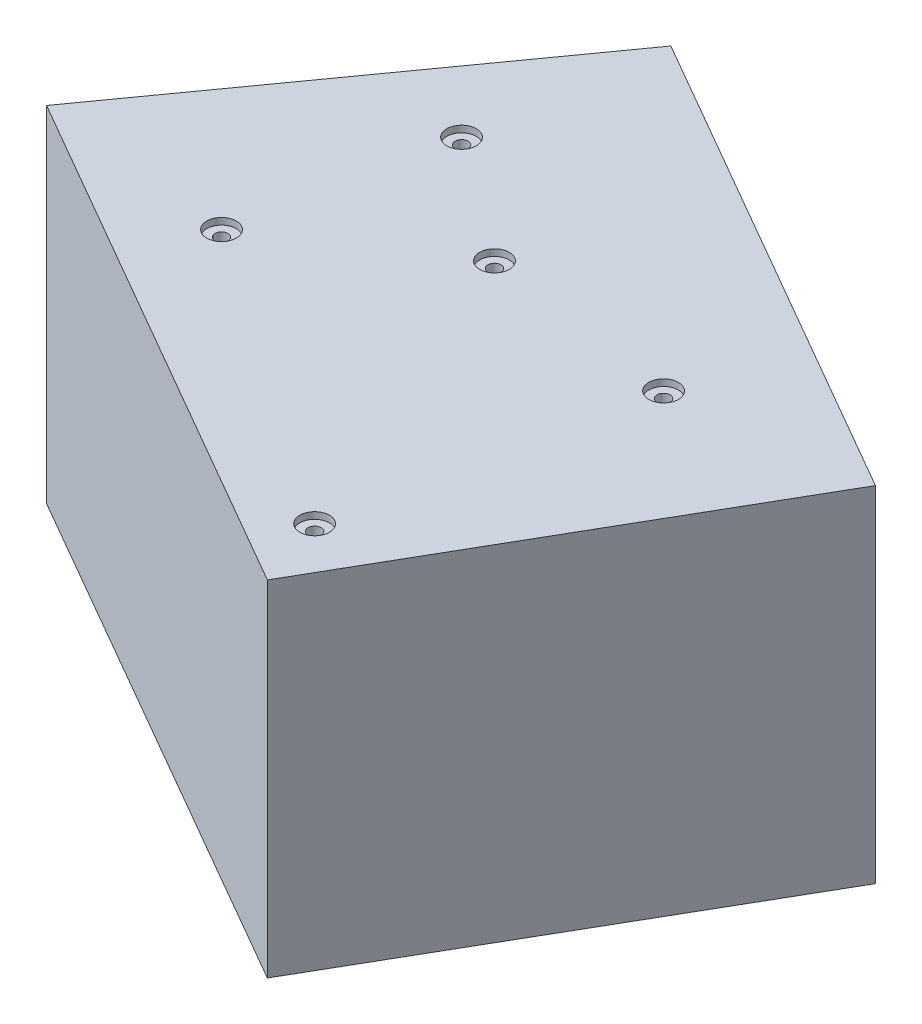
ISO-10303-21;
HEADER;
FILE_DESCRIPTION(('STEP AP214'),'2;1');
FILE_NAME('part.step','',(''),(''),'','','');
FILE_SCHEMA(('AUTOMOTIVE_DESIGN { 1 0 10303 214 1 1 1 1 }'));
ENDSEC;
DATA;
#1=APPLICATION_CONTEXT('core data for automotive mechanical design processes');
#2=APPLICATION_PROTOCOL_DEFINITION('international standard','automotive_design',2000,#1);
#3=PRODUCT_CONTEXT('',#1,'mechanical');
#4=PRODUCT('Part','Part','',(#3));
#5=PRODUCT_RELATED_PRODUCT_CATEGORY('part','',(#4));
#6=PRODUCT_DEFINITION_FORMATION('','',#4);
#7=PRODUCT_DEFINITION_CONTEXT('part definition',#1,'design');
#8=PRODUCT_DEFINITION('design','',#6,#7);
#9=PRODUCT_DEFINITION_SHAPE('','',#8);
#10=(LENGTH_UNIT() NAMED_UNIT(*) SI_UNIT(.MILLI.,.METRE.));
#11=(NAMED_UNIT(*) PLANE_ANGLE_UNIT() SI_UNIT($,.RADIAN.));
#12=(NAMED_UNIT(*) SI_UNIT($,.STERADIAN.) SOLID_ANGLE_UNIT());
#13=UNCERTAINTY_MEASURE_WITH_UNIT(LENGTH_MEASURE(1.E-05),#10,'distance_accuracy_value','');
#14=(GEOMETRIC_REPRESENTATION_CONTEXT(3) GLOBAL_UNCERTAINTY_ASSIGNED_CONTEXT((#13)) GLOBAL_UNIT_ASSIGNED_CONTEXT((#10,
#11,#12)) REPRESENTATION_CONTEXT('',''));
#15=CARTESIAN_POINT('',(0.,0.,0.));
#16=DIRECTION('',(0.,0.,1.));
#17=DIRECTION('',(1.,0.,0.));
#18=AXIS2_PLACEMENT_3D('',#15,#16,#17);
#19=CARTESIAN_POINT('',(20.345351388883,37.,-35.2961020307136));
#20=DIRECTION('',(-0.499394896140882,0.,0.866374478911075));
#21=DIRECTION('',(0.866374478911076,0.,0.499394896140882));
#22=AXIS2_PLACEMENT_3D('',#19,#20,#21);
#23=PLANE('',#22);
#24=DIRECTION('',(-0.866374478911076,0.,-0.499394896140882));
#25=VECTOR('',#24,1.);
#26=CARTESIAN_POINT('',(20.345351388883,0.,-35.2961020307136));
#27=LINE('',#26,#25);
#28=CARTESIAN_POINT('',(41.3321038299781,0.,-23.1989346847549));
#29=VERTEX_POINT('',#28);
#30=CARTESIAN_POINT('',(-10.5053924694506,0.,-53.0790635560413));
#31=VERTEX_POINT('',#30);
#32=EDGE_CURVE('E96',#29,#31,#27,.T.);
#33=ORIENTED_EDGE('',*,*,#32,.T.);
#34=DIRECTION('',(0.,-1.,0.));
#35=VECTOR('',#34,1.);
#36=CARTESIAN_POINT('',(-10.5053924694506,37.,-53.0790635560413));
#37=LINE('',#36,#35);
#38=CARTESIAN_POINT('',(-10.5053924694506,37.,-53.0790635560413));
#39=VERTEX_POINT('',#38);
#40=EDGE_CURVE('E11',#39,#31,#37,.T.);
#41=ORIENTED_EDGE('',*,*,#40,.F.);
#42=DIRECTION('',(-0.866374478911076,0.,-0.499394896140882));
#43=VECTOR('',#42,1.);
#44=CARTESIAN_POINT('',(20.345351388883,37.,-35.2961020307136));
#45=LINE('',#44,#43);
#46=CARTESIAN_POINT('',(41.3321038299781,37.,-23.1989346847549));
#47=VERTEX_POINT('',#46);
#48=EDGE_CURVE('E84',#47,#39,#45,.T.);
#49=ORIENTED_EDGE('',*,*,#48,.F.);
#50=DIRECTION('',(0.,-1.,0.));
#51=VECTOR('',#50,1.);
#52=CARTESIAN_POINT('',(41.3321038299781,37.,-23.1989346847549));
#53=LINE('',#52,#51);
#54=EDGE_CURVE('E92',#47,#29,#53,.T.);
#55=ORIENTED_EDGE('',*,*,#54,.T.);
#56=EDGE_LOOP('',(#33,#41,#49,#55));
#57=FACE_BOUND('',#56,.T.);
#58=ADVANCED_FACE('F33',(#57),#23,.F.);
#59=CARTESIAN_POINT('',(-32.0727236267582,37.,-22.9865477615255));
#60=DIRECTION('',(0.812803978277664,0.,0.582537288845961));
#61=DIRECTION('',(0.582537288845961,0.,-0.812803978277664));
#62=AXIS2_PLACEMENT_3D('',#59,#60,#61);
#63=PLANE('',#62);
#64=DIRECTION('',(-0.582537288845961,0.,0.812803978277664));
#65=VECTOR('',#64,1.);
#66=CARTESIAN_POINT('',(-32.0727236267582,0.,-22.9865477615255));
#67=LINE('',#66,#65);
#68=CARTESIAN_POINT('',(-38.4790538125223,0.,-14.0479085347304));
#69=VERTEX_POINT('',#68);
#70=EDGE_CURVE('E88',#31,#69,#67,.T.);
#71=ORIENTED_EDGE('',*,*,#70,.T.);
#72=DIRECTION('',(0.,-1.,0.));
#73=VECTOR('',#72,1.);
#74=CARTESIAN_POINT('',(-38.4790538125223,37.,-14.0479085347304));
#75=LINE('',#74,#73);
#76=CARTESIAN_POINT('',(-38.4790538125223,37.,-14.0479085347304));
#77=VERTEX_POINT('',#76);
#78=EDGE_CURVE('E41',#77,#69,#75,.T.);
#79=ORIENTED_EDGE('',*,*,#78,.F.);
#80=DIRECTION('',(-0.582537288845961,0.,0.812803978277664));
#81=VECTOR('',#80,1.);
#82=CARTESIAN_POINT('',(-32.0727236267582,37.,-22.9865477615255));
#83=LINE('',#82,#81);
#84=EDGE_CURVE('E79',#39,#77,#83,.T.);
#85=ORIENTED_EDGE('',*,*,#84,.F.);
#86=ORIENTED_EDGE('',*,*,#40,.T.);
#87=EDGE_LOOP('',(#71,#79,#85,#86));
#88=FACE_BOUND('',#87,.T.);
#89=ADVANCED_FACE('F87',(#88),#63,.F.);
#90=CARTESIAN_POINT('',(-3.51848356747383,37.,6.10403588599627));
#91=DIRECTION('',(0.499394896140882,0.,-0.866374478911075));
#92=DIRECTION('',(-0.866374478911076,0.,-0.499394896140882));
#93=AXIS2_PLACEMENT_3D('',#90,#91,#92);
#94=PLANE('',#93);
#95=DIRECTION('',(0.866374478911076,0.,0.499394896140882));
#96=VECTOR('',#95,1.);
#97=CARTESIAN_POINT('',(-3.51848356747383,0.,6.10403588599627));
#98=LINE('',#97,#96);
#99=CARTESIAN_POINT('',(17.4682688736212,0.,18.201203231955));
#100=VERTEX_POINT('',#99);
#101=EDGE_CURVE('E66',#69,#100,#98,.T.);
#102=ORIENTED_EDGE('',*,*,#101,.T.);
#103=DIRECTION('',(0.,-1.,0.));
#104=VECTOR('',#103,1.);
#105=CARTESIAN_POINT('',(17.4682688736212,37.,18.201203231955));
#106=LINE('',#105,#104);
#107=CARTESIAN_POINT('',(17.4682688736212,37.,18.201203231955));
#108=VERTEX_POINT('',#107);
#109=EDGE_CURVE('E89',#108,#100,#106,.T.);
#110=ORIENTED_EDGE('',*,*,#109,.F.);
#111=DIRECTION('',(0.866374478911076,0.,0.499394896140882));
#112=VECTOR('',#111,1.);
#113=CARTESIAN_POINT('',(-3.51848356747383,37.,6.10403588599627));
#114=LINE('',#113,#112);
#115=EDGE_CURVE('E82',#77,#108,#114,.T.);
#116=ORIENTED_EDGE('',*,*,#115,.F.);
#117=ORIENTED_EDGE('',*,*,#78,.T.);
#118=EDGE_LOOP('',(#102,#110,#116,#117));
#119=FACE_BOUND('',#118,.T.);
#120=ADVANCED_FACE('F90',(#119),#94,.F.);
#121=CARTESIAN_POINT('',(20.9867524410951,37.,12.0971673459587));
#122=DIRECTION('',(-0.866374478911075,0.,-0.499394896140882));
#123=DIRECTION('',(-0.499394896140882,0.,0.866374478911075));
#124=AXIS2_PLACEMENT_3D('',#121,#122,#123);
#125=PLANE('',#124);
#126=DIRECTION('',(0.499394896140882,0.,-0.866374478911075));
#127=VECTOR('',#126,1.);
#128=CARTESIAN_POINT('',(20.9867524410951,0.,12.0971673459587));
#129=LINE('',#128,#127);
#130=EDGE_CURVE('E72',#100,#29,#129,.T.);
#131=ORIENTED_EDGE('',*,*,#130,.T.);
#132=ORIENTED_EDGE('',*,*,#54,.F.);
#133=DIRECTION('',(0.499394896140882,0.,-0.866374478911075));
#134=VECTOR('',#133,1.);
#135=CARTESIAN_POINT('',(20.9867524410951,37.,12.0971673459587));
#136=LINE('',#135,#134);
#137=EDGE_CURVE('E49',#108,#47,#136,.T.);
#138=ORIENTED_EDGE('',*,*,#137,.F.);
#139=ORIENTED_EDGE('',*,*,#109,.T.);
#140=EDGE_LOOP('',(#131,#132,#138,#139));
#141=FACE_BOUND('',#140,.T.);
#142=ADVANCED_FACE('F104',(#141),#125,.F.);
#143=CARTESIAN_POINT('',(0.,37.,0.));
#144=DIRECTION('',(0.,1.,0.));
#145=DIRECTION('',(0.,0.,1.));
#146=AXIS2_PLACEMENT_3D('',#143,#144,#145);
#147=PLANE('',#146);
#148=CARTESIAN_POINT('',(14.7823041001516,37.,10.4421374865638));
#149=DIRECTION('',(0.,1.,0.));
#150=DIRECTION('',(0.,0.,1.));
#151=AXIS2_PLACEMENT_3D('',#148,#149,#150);
#152=CIRCLE('',#151,1.5875);
#153=CARTESIAN_POINT('',(14.7823041001516,37.,12.0296374865637));
#154=VERTEX_POINT('',#153);
#155=EDGE_CURVE('E166',#154,#154,#152,.T.);
#156=ORIENTED_EDGE('',*,*,#155,.F.);
#157=EDGE_LOOP('',(#156));
#158=FACE_BOUND('',#157,.T.);
#159=CARTESIAN_POINT('',(0.,37.,-23.6416541667381));
#160=DIRECTION('',(0.,1.,0.));
#161=DIRECTION('',(0.,0.,1.));
#162=AXIS2_PLACEMENT_3D('',#159,#160,#161);
#163=CIRCLE('',#162,1.5875);
#164=CARTESIAN_POINT('',(0.,37.,-22.0541541667381));
#165=VERTEX_POINT('',#164);
#166=EDGE_CURVE('E154',#165,#165,#163,.T.);
#167=ORIENTED_EDGE('',*,*,#166,.F.);
#168=EDGE_LOOP('',(#167));
#169=FACE_BOUND('',#168,.T.);
#170=CARTESIAN_POINT('',(21.1628590037662,37.,-20.6303003542985));
#171=DIRECTION('',(0.,1.,0.));
#172=DIRECTION('',(0.,0.,1.));
#173=AXIS2_PLACEMENT_3D('',#170,#171,#172);
#174=CIRCLE('',#173,1.5875);
#175=CARTESIAN_POINT('',(21.1628590037662,37.,-19.0428003542985));
#176=VERTEX_POINT('',#175);
#177=EDGE_CURVE('E142',#176,#176,#174,.T.);
#178=ORIENTED_EDGE('',*,*,#177,.F.);
#179=EDGE_LOOP('',(#178));
#180=FACE_BOUND('',#179,.T.);
#181=CARTESIAN_POINT('',(-17.558591276611,37.,-11.9070774753709));
#182=DIRECTION('',(0.,1.,0.));
#183=DIRECTION('',(0.,0.,1.));
#184=AXIS2_PLACEMENT_3D('',#181,#182,#183);
#185=CIRCLE('',#184,1.5875);
#186=CARTESIAN_POINT('',(-17.558591276611,37.,-10.3195774753709));
#187=VERTEX_POINT('',#186);
#188=EDGE_CURVE('E130',#187,#187,#185,.T.);
#189=ORIENTED_EDGE('',*,*,#188,.F.);
#190=EDGE_LOOP('',(#189));
#191=FACE_BOUND('',#190,.T.);
#192=CARTESIAN_POINT('',(-13.2542559478566,37.,-33.3667928831005));
#193=DIRECTION('',(0.,1.,0.));
#194=DIRECTION('',(0.,0.,1.));
#195=AXIS2_PLACEMENT_3D('',#192,#193,#194);
#196=CIRCLE('',#195,1.5875);
#197=CARTESIAN_POINT('',(-13.2542559478566,37.,-31.7792928831005));
#198=VERTEX_POINT('',#197);
#199=EDGE_CURVE('E118',#198,#198,#196,.T.);
#200=ORIENTED_EDGE('',*,*,#199,.F.);
#201=EDGE_LOOP('',(#200));
#202=FACE_BOUND('',#201,.T.);
#203=ORIENTED_EDGE('',*,*,#48,.T.);
#204=ORIENTED_EDGE('',*,*,#84,.T.);
#205=ORIENTED_EDGE('',*,*,#115,.T.);
#206=ORIENTED_EDGE('',*,*,#137,.T.);
#207=EDGE_LOOP('',(#203,#204,#205,#206));
#208=FACE_BOUND('',#207,.T.);
#209=ADVANCED_FACE('F80',(#158,#169,#180,#191,#202,#208),#147,.T.);
#210=CARTESIAN_POINT('',(0.,0.,0.));
#211=DIRECTION('',(0.,1.,0.));
#212=DIRECTION('',(0.,0.,1.));
#213=AXIS2_PLACEMENT_3D('',#210,#211,#212);
#214=PLANE('',#213);
#215=CARTESIAN_POINT('',(14.7823041001516,0.,10.4421374865638));
#216=DIRECTION('',(0.,1.,0.));
#217=DIRECTION('',(0.,0.,1.));
#218=AXIS2_PLACEMENT_3D('',#215,#216,#217);
#219=CIRCLE('',#218,0.698499999999991);
#220=CARTESIAN_POINT('',(14.7823041001516,0.,11.1406374865637));
#221=VERTEX_POINT('',#220);
#222=EDGE_CURVE('E157',#221,#221,#219,.T.);
#223=ORIENTED_EDGE('',*,*,#222,.T.);
#224=EDGE_LOOP('',(#223));
#225=FACE_BOUND('',#224,.T.);
#226=CARTESIAN_POINT('',(0.,0.,-23.6416541667381));
#227=DIRECTION('',(0.,1.,0.));
#228=DIRECTION('',(0.,0.,1.));
#229=AXIS2_PLACEMENT_3D('',#226,#227,#228);
#230=CIRCLE('',#229,0.698499999999991);
#231=CARTESIAN_POINT('',(0.,0.,-22.9431541667381));
#232=VERTEX_POINT('',#231);
#233=EDGE_CURVE('E145',#232,#232,#230,.T.);
#234=ORIENTED_EDGE('',*,*,#233,.T.);
#235=EDGE_LOOP('',(#234));
#236=FACE_BOUND('',#235,.T.);
#237=CARTESIAN_POINT('',(21.1628590037662,0.,-20.6303003542985));
#238=DIRECTION('',(0.,1.,0.));
#239=DIRECTION('',(0.,0.,1.));
#240=AXIS2_PLACEMENT_3D('',#237,#238,#239);
#241=CIRCLE('',#240,0.698499999999991);
#242=CARTESIAN_POINT('',(21.1628590037662,0.,-19.9318003542985));
#243=VERTEX_POINT('',#242);
#244=EDGE_CURVE('E133',#243,#243,#241,.T.);
#245=ORIENTED_EDGE('',*,*,#244,.T.);
#246=EDGE_LOOP('',(#245));
#247=FACE_BOUND('',#246,.T.);
#248=CARTESIAN_POINT('',(-17.558591276611,0.,-11.9070774753709));
#249=DIRECTION('',(0.,1.,0.));
#250=DIRECTION('',(0.,0.,1.));
#251=AXIS2_PLACEMENT_3D('',#248,#249,#250);
#252=CIRCLE('',#251,0.698499999999991);
#253=CARTESIAN_POINT('',(-17.558591276611,0.,-11.2085774753709));
#254=VERTEX_POINT('',#253);
#255=EDGE_CURVE('E121',#254,#254,#252,.T.);
#256=ORIENTED_EDGE('',*,*,#255,.T.);
#257=EDGE_LOOP('',(#256));
#258=FACE_BOUND('',#257,.T.);
#259=CARTESIAN_POINT('',(-13.2542559478566,0.,-33.3667928831005));
#260=DIRECTION('',(0.,1.,0.));
#261=DIRECTION('',(0.,0.,1.));
#262=AXIS2_PLACEMENT_3D('',#259,#260,#261);
#263=CIRCLE('',#262,0.698499999999991);
#264=CARTESIAN_POINT('',(-13.2542559478566,0.,-32.6682928831005));
#265=VERTEX_POINT('',#264);
#266=EDGE_CURVE('E99',#265,#265,#263,.T.);
#267=ORIENTED_EDGE('',*,*,#266,.T.);
#268=EDGE_LOOP('',(#267));
#269=FACE_BOUND('',#268,.T.);
#270=ORIENTED_EDGE('',*,*,#32,.F.);
#271=ORIENTED_EDGE('',*,*,#130,.F.);
#272=ORIENTED_EDGE('',*,*,#101,.F.);
#273=ORIENTED_EDGE('',*,*,#70,.F.);
#274=EDGE_LOOP('',(#270,#271,#272,#273));
#275=FACE_BOUND('',#274,.T.);
#276=ADVANCED_FACE('F107',(#225,#236,#247,#258,#269,#275),#214,.F.);
#277=CARTESIAN_POINT('',(-13.2542559478566,37.,-33.3667928831005));
#278=DIRECTION('',(0.,1.,0.));
#279=DIRECTION('',(0.,0.,1.));
#280=AXIS2_PLACEMENT_3D('',#277,#278,#279);
#281=CYLINDRICAL_SURFACE('',#280,0.698499999999995);
#282=ORIENTED_EDGE('',*,*,#266,.F.);
#283=EDGE_LOOP('',(#282));
#284=FACE_BOUND('',#283,.T.);
#285=CARTESIAN_POINT('',(-13.2542559478566,36.2888,-33.3667928831005));
#286=DIRECTION('',(0.,1.,0.));
#287=DIRECTION('',(0.,0.,1.));
#288=AXIS2_PLACEMENT_3D('',#285,#286,#287);
#289=CIRCLE('',#288,0.698499999999999);
#290=CARTESIAN_POINT('',(-13.2542559478566,36.2888,-32.6682928831005));
#291=VERTEX_POINT('',#290);
#292=EDGE_CURVE('E112',#291,#291,#289,.T.);
#293=ORIENTED_EDGE('',*,*,#292,.T.);
#294=EDGE_LOOP('',(#293));
#295=FACE_BOUND('',#294,.T.);
#296=ADVANCED_FACE('F196',(#284,#295),#281,.F.);
#297=CARTESIAN_POINT('',(-12.5557559478566,36.2888,-33.3667928831005));
#298=DIRECTION('',(0.,-1.,0.));
#299=DIRECTION('',(0.,0.,-1.));
#300=AXIS2_PLACEMENT_3D('',#297,#298,#299);
#301=PLANE('',#300);
#302=ORIENTED_EDGE('',*,*,#292,.F.);
#303=EDGE_LOOP('',(#302));
#304=FACE_BOUND('',#303,.T.);
#305=CARTESIAN_POINT('',(-13.2542559478566,36.2888,-33.3667928831005));
#306=DIRECTION('',(0.,1.,0.));
#307=DIRECTION('',(0.,0.,1.));
#308=AXIS2_PLACEMENT_3D('',#305,#306,#307);
#309=CIRCLE('',#308,1.5875);
#310=CARTESIAN_POINT('',(-13.2542559478566,36.2888,-31.7792928831005));
#311=VERTEX_POINT('',#310);
#312=EDGE_CURVE('E115',#311,#311,#309,.T.);
#313=ORIENTED_EDGE('',*,*,#312,.T.);
#314=EDGE_LOOP('',(#313));
#315=FACE_BOUND('',#314,.T.);
#316=ADVANCED_FACE('F186',(#304,#315),#301,.F.);
#317=CARTESIAN_POINT('',(-13.2542559478566,37.,-33.3667928831005));
#318=DIRECTION('',(0.,1.,0.));
#319=DIRECTION('',(0.,0.,1.));
#320=AXIS2_PLACEMENT_3D('',#317,#318,#319);
#321=CYLINDRICAL_SURFACE('',#320,1.5875);
#322=ORIENTED_EDGE('',*,*,#312,.F.);
#323=EDGE_LOOP('',(#322));
#324=FACE_BOUND('',#323,.T.);
#325=ORIENTED_EDGE('',*,*,#199,.T.);
#326=EDGE_LOOP('',(#325));
#327=FACE_BOUND('',#326,.T.);
#328=ADVANCED_FACE('F183',(#324,#327),#321,.F.);
#329=CARTESIAN_POINT('',(-17.558591276611,37.,-11.9070774753709));
#330=DIRECTION('',(0.,1.,0.));
#331=DIRECTION('',(0.,0.,1.));
#332=AXIS2_PLACEMENT_3D('',#329,#330,#331);
#333=CYLINDRICAL_SURFACE('',#332,0.698499999999996);
#334=ORIENTED_EDGE('',*,*,#255,.F.);
#335=EDGE_LOOP('',(#334));
#336=FACE_BOUND('',#335,.T.);
#337=CARTESIAN_POINT('',(-17.558591276611,36.2888,-11.9070774753709));
#338=DIRECTION('',(0.,1.,0.));
#339=DIRECTION('',(0.,0.,1.));
#340=AXIS2_PLACEMENT_3D('',#337,#338,#339);
#341=CIRCLE('',#340,0.698500000000001);
#342=CARTESIAN_POINT('',(-17.558591276611,36.2888,-11.2085774753709));
#343=VERTEX_POINT('',#342);
#344=EDGE_CURVE('E124',#343,#343,#341,.T.);
#345=ORIENTED_EDGE('',*,*,#344,.T.);
#346=EDGE_LOOP('',(#345));
#347=FACE_BOUND('',#346,.T.);
#348=ADVANCED_FACE('F185',(#336,#347),#333,.F.);
#349=CARTESIAN_POINT('',(-16.860091276611,36.2888,-11.9070774753709));
#350=DIRECTION('',(0.,-1.,0.));
#351=DIRECTION('',(0.,0.,-1.));
#352=AXIS2_PLACEMENT_3D('',#349,#350,#351);
#353=PLANE('',#352);
#354=ORIENTED_EDGE('',*,*,#344,.F.);
#355=EDGE_LOOP('',(#354));
#356=FACE_BOUND('',#355,.T.);
#357=CARTESIAN_POINT('',(-17.558591276611,36.2888,-11.9070774753709));
#358=DIRECTION('',(0.,1.,0.));
#359=DIRECTION('',(0.,0.,1.));
#360=AXIS2_PLACEMENT_3D('',#357,#358,#359);
#361=CIRCLE('',#360,1.5875);
#362=CARTESIAN_POINT('',(-17.558591276611,36.2888,-10.3195774753709));
#363=VERTEX_POINT('',#362);
#364=EDGE_CURVE('E127',#363,#363,#361,.T.);
#365=ORIENTED_EDGE('',*,*,#364,.T.);
#366=EDGE_LOOP('',(#365));
#367=FACE_BOUND('',#366,.T.);
#368=ADVANCED_FACE('F193',(#356,#367),#353,.F.);
#369=CARTESIAN_POINT('',(-17.558591276611,37.,-11.9070774753709));
#370=DIRECTION('',(0.,1.,0.));
#371=DIRECTION('',(0.,0.,1.));
#372=AXIS2_PLACEMENT_3D('',#369,#370,#371);
#373=CYLINDRICAL_SURFACE('',#372,1.5875);
#374=ORIENTED_EDGE('',*,*,#364,.F.);
#375=EDGE_LOOP('',(#374));
#376=FACE_BOUND('',#375,.T.);
#377=ORIENTED_EDGE('',*,*,#188,.T.);
#378=EDGE_LOOP('',(#377));
#379=FACE_BOUND('',#378,.T.);
#380=ADVANCED_FACE('F248',(#376,#379),#373,.F.);
#381=CARTESIAN_POINT('',(21.1628590037662,37.,-20.6303003542985));
#382=DIRECTION('',(0.,1.,0.));
#383=DIRECTION('',(0.,0.,1.));
#384=AXIS2_PLACEMENT_3D('',#381,#382,#383);
#385=CYLINDRICAL_SURFACE('',#384,0.698499999999996);
#386=ORIENTED_EDGE('',*,*,#244,.F.);
#387=EDGE_LOOP('',(#386));
#388=FACE_BOUND('',#387,.T.);
#389=CARTESIAN_POINT('',(21.1628590037662,36.2888,-20.6303003542985));
#390=DIRECTION('',(0.,1.,0.));
#391=DIRECTION('',(0.,0.,1.));
#392=AXIS2_PLACEMENT_3D('',#389,#390,#391);
#393=CIRCLE('',#392,0.698500000000001);
#394=CARTESIAN_POINT('',(21.1628590037662,36.2888,-19.9318003542985));
#395=VERTEX_POINT('',#394);
#396=EDGE_CURVE('E136',#395,#395,#393,.T.);
#397=ORIENTED_EDGE('',*,*,#396,.T.);
#398=EDGE_LOOP('',(#397));
#399=FACE_BOUND('',#398,.T.);
#400=ADVANCED_FACE('F258',(#388,#399),#385,.F.);
#401=CARTESIAN_POINT('',(21.8613590037662,36.2888,-20.6303003542985));
#402=DIRECTION('',(0.,-1.,0.));
#403=DIRECTION('',(0.,0.,-1.));
#404=AXIS2_PLACEMENT_3D('',#401,#402,#403);
#405=PLANE('',#404);
#406=ORIENTED_EDGE('',*,*,#396,.F.);
#407=EDGE_LOOP('',(#406));
#408=FACE_BOUND('',#407,.T.);
#409=CARTESIAN_POINT('',(21.1628590037662,36.2888,-20.6303003542985));
#410=DIRECTION('',(0.,1.,0.));
#411=DIRECTION('',(0.,0.,1.));
#412=AXIS2_PLACEMENT_3D('',#409,#410,#411);
#413=CIRCLE('',#412,1.5875);
#414=CARTESIAN_POINT('',(21.1628590037662,36.2888,-19.0428003542985));
#415=VERTEX_POINT('',#414);
#416=EDGE_CURVE('E139',#415,#415,#413,.T.);
#417=ORIENTED_EDGE('',*,*,#416,.T.);
#418=EDGE_LOOP('',(#417));
#419=FACE_BOUND('',#418,.T.);
#420=ADVANCED_FACE('F268',(#408,#419),#405,.F.);
#421=CARTESIAN_POINT('',(21.1628590037662,37.,-20.6303003542985));
#422=DIRECTION('',(0.,1.,0.));
#423=DIRECTION('',(0.,0.,1.));
#424=AXIS2_PLACEMENT_3D('',#421,#422,#423);
#425=CYLINDRICAL_SURFACE('',#424,1.5875);
#426=ORIENTED_EDGE('',*,*,#416,.F.);
#427=EDGE_LOOP('',(#426));
#428=FACE_BOUND('',#427,.T.);
#429=ORIENTED_EDGE('',*,*,#177,.T.);
#430=EDGE_LOOP('',(#429));
#431=FACE_BOUND('',#430,.T.);
#432=ADVANCED_FACE('F278',(#428,#431),#425,.F.);
#433=CARTESIAN_POINT('',(0.,37.,-23.6416541667381));
#434=DIRECTION('',(0.,1.,0.));
#435=DIRECTION('',(0.,0.,1.));
#436=AXIS2_PLACEMENT_3D('',#433,#434,#435);
#437=CYLINDRICAL_SURFACE('',#436,0.698499999999995);
#438=ORIENTED_EDGE('',*,*,#233,.F.);
#439=EDGE_LOOP('',(#438));
#440=FACE_BOUND('',#439,.T.);
#441=CARTESIAN_POINT('',(0.,36.2888,-23.6416541667381));
#442=DIRECTION('',(0.,1.,0.));
#443=DIRECTION('',(0.,0.,1.));
#444=AXIS2_PLACEMENT_3D('',#441,#442,#443);
#445=CIRCLE('',#444,0.6985);
#446=CARTESIAN_POINT('',(0.,36.2888,-22.9431541667381));
#447=VERTEX_POINT('',#446);
#448=EDGE_CURVE('E148',#447,#447,#445,.T.);
#449=ORIENTED_EDGE('',*,*,#448,.T.);
#450=EDGE_LOOP('',(#449));
#451=FACE_BOUND('',#450,.T.);
#452=ADVANCED_FACE('F288',(#440,#451),#437,.F.);
#453=CARTESIAN_POINT('',(0.6985,36.2888,-23.6416541667381));
#454=DIRECTION('',(0.,-1.,0.));
#455=DIRECTION('',(0.,0.,-1.));
#456=AXIS2_PLACEMENT_3D('',#453,#454,#455);
#457=PLANE('',#456);
#458=ORIENTED_EDGE('',*,*,#448,.F.);
#459=EDGE_LOOP('',(#458));
#460=FACE_BOUND('',#459,.T.);
#461=CARTESIAN_POINT('',(0.,36.2888,-23.6416541667381));
#462=DIRECTION('',(0.,1.,0.));
#463=DIRECTION('',(0.,0.,1.));
#464=AXIS2_PLACEMENT_3D('',#461,#462,#463);
#465=CIRCLE('',#464,1.5875);
#466=CARTESIAN_POINT('',(0.,36.2888,-22.0541541667381));
#467=VERTEX_POINT('',#466);
#468=EDGE_CURVE('E151',#467,#467,#465,.T.);
#469=ORIENTED_EDGE('',*,*,#468,.T.);
#470=EDGE_LOOP('',(#469));
#471=FACE_BOUND('',#470,.T.);
#472=ADVANCED_FACE('F298',(#460,#471),#457,.F.);
#473=CARTESIAN_POINT('',(0.,37.,-23.6416541667381));
#474=DIRECTION('',(0.,1.,0.));
#475=DIRECTION('',(0.,0.,1.));
#476=AXIS2_PLACEMENT_3D('',#473,#474,#475);
#477=CYLINDRICAL_SURFACE('',#476,1.5875);
#478=ORIENTED_EDGE('',*,*,#468,.F.);
#479=EDGE_LOOP('',(#478));
#480=FACE_BOUND('',#479,.T.);
#481=ORIENTED_EDGE('',*,*,#166,.T.);
#482=EDGE_LOOP('',(#481));
#483=FACE_BOUND('',#482,.T.);
#484=ADVANCED_FACE('F308',(#480,#483),#477,.F.);
#485=CARTESIAN_POINT('',(14.7823041001516,37.,10.4421374865638));
#486=DIRECTION('',(0.,1.,0.));
#487=DIRECTION('',(0.,0.,1.));
#488=AXIS2_PLACEMENT_3D('',#485,#486,#487);
#489=CYLINDRICAL_SURFACE('',#488,0.698499999999995);
#490=ORIENTED_EDGE('',*,*,#222,.F.);
#491=EDGE_LOOP('',(#490));
#492=FACE_BOUND('',#491,.T.);
#493=CARTESIAN_POINT('',(14.7823041001516,36.2888,10.4421374865638));
#494=DIRECTION('',(0.,1.,0.));
#495=DIRECTION('',(0.,0.,1.));
#496=AXIS2_PLACEMENT_3D('',#493,#494,#495);
#497=CIRCLE('',#496,0.698499999999999);
#498=CARTESIAN_POINT('',(14.7823041001516,36.2888,11.1406374865638));
#499=VERTEX_POINT('',#498);
#500=EDGE_CURVE('E160',#499,#499,#497,.T.);
#501=ORIENTED_EDGE('',*,*,#500,.T.);
#502=EDGE_LOOP('',(#501));
#503=FACE_BOUND('',#502,.T.);
#504=ADVANCED_FACE('F318',(#492,#503),#489,.F.);
#505=CARTESIAN_POINT('',(15.4808041001516,36.2888,10.4421374865638));
#506=DIRECTION('',(0.,-1.,0.));
#507=DIRECTION('',(0.,0.,-1.));
#508=AXIS2_PLACEMENT_3D('',#505,#506,#507);
#509=PLANE('',#508);
#510=ORIENTED_EDGE('',*,*,#500,.F.);
#511=EDGE_LOOP('',(#510));
#512=FACE_BOUND('',#511,.T.);
#513=CARTESIAN_POINT('',(14.7823041001516,36.2888,10.4421374865638));
#514=DIRECTION('',(0.,1.,0.));
#515=DIRECTION('',(0.,0.,1.));
#516=AXIS2_PLACEMENT_3D('',#513,#514,#515);
#517=CIRCLE('',#516,1.5875);
#518=CARTESIAN_POINT('',(14.7823041001516,36.2888,12.0296374865637));
#519=VERTEX_POINT('',#518);
#520=EDGE_CURVE('E163',#519,#519,#517,.T.);
#521=ORIENTED_EDGE('',*,*,#520,.T.);
#522=EDGE_LOOP('',(#521));
#523=FACE_BOUND('',#522,.T.);
#524=ADVANCED_FACE('F328',(#512,#523),#509,.F.);
#525=CARTESIAN_POINT('',(14.7823041001516,37.,10.4421374865638));
#526=DIRECTION('',(0.,1.,0.));
#527=DIRECTION('',(0.,0.,1.));
#528=AXIS2_PLACEMENT_3D('',#525,#526,#527);
#529=CYLINDRICAL_SURFACE('',#528,1.5875);
#530=ORIENTED_EDGE('',*,*,#520,.F.);
#531=EDGE_LOOP('',(#530));
#532=FACE_BOUND('',#531,.T.);
#533=ORIENTED_EDGE('',*,*,#155,.T.);
#534=EDGE_LOOP('',(#533));
#535=FACE_BOUND('',#534,.T.);
#536=ADVANCED_FACE('F170',(#532,#535),#529,.F.);
#537=CLOSED_SHELL('',(#58,#89,#120,#142,#209,#276,#296,#316,#328,#348,#368,#380,#400,#420,#432,
#452,#472,#484,#504,#524,#536));
#538=MANIFOLD_SOLID_BREP('B2',#537);
#539=ADVANCED_BREP_SHAPE_REPRESENTATION('',(#18,#538),#14);
#540=SHAPE_DEFINITION_REPRESENTATION(#9,#539);
ENDSEC;
END-ISO-10303-21;
